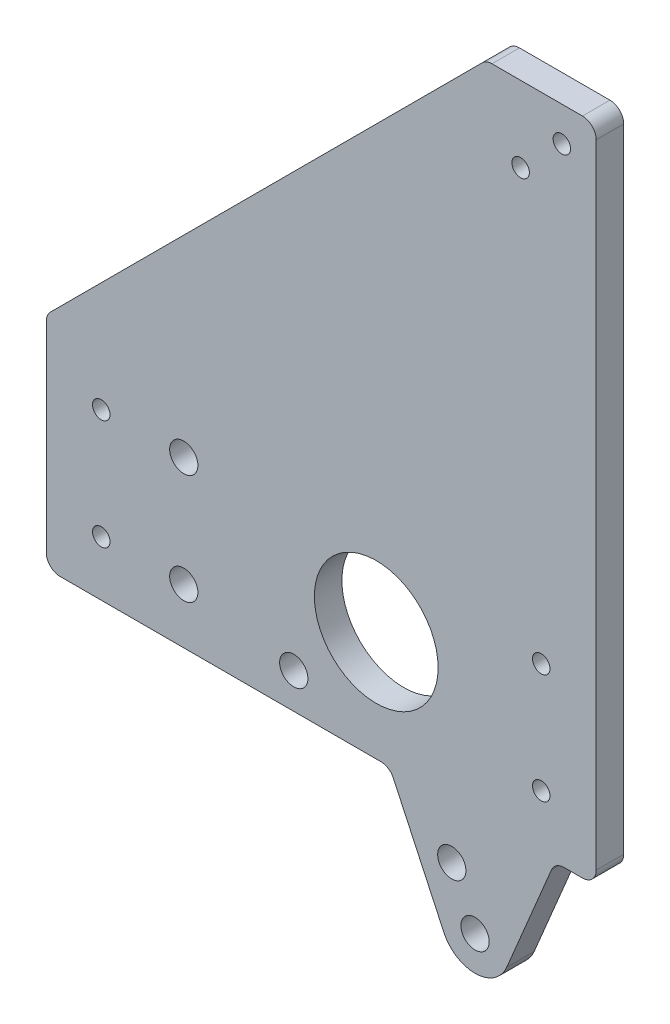
ISO-10303-21;
HEADER;
FILE_DESCRIPTION(('STEP AP214'),'2;1');
FILE_NAME('part.step','',(''),(''),'','','');
FILE_SCHEMA(('AUTOMOTIVE_DESIGN { 1 0 10303 214 1 1 1 1 }'));
ENDSEC;
DATA;
#1=APPLICATION_CONTEXT('core data for automotive mechanical design processes');
#2=APPLICATION_PROTOCOL_DEFINITION('international standard','automotive_design',2000,#1);
#3=PRODUCT_CONTEXT('',#1,'mechanical');
#4=PRODUCT('Part','Part','',(#3));
#5=PRODUCT_RELATED_PRODUCT_CATEGORY('part','',(#4));
#6=PRODUCT_DEFINITION_FORMATION('','',#4);
#7=PRODUCT_DEFINITION_CONTEXT('part definition',#1,'design');
#8=PRODUCT_DEFINITION('design','',#6,#7);
#9=PRODUCT_DEFINITION_SHAPE('','',#8);
#10=(LENGTH_UNIT() NAMED_UNIT(*) SI_UNIT(.MILLI.,.METRE.));
#11=(NAMED_UNIT(*) PLANE_ANGLE_UNIT() SI_UNIT($,.RADIAN.));
#12=(NAMED_UNIT(*) SI_UNIT($,.STERADIAN.) SOLID_ANGLE_UNIT());
#13=UNCERTAINTY_MEASURE_WITH_UNIT(LENGTH_MEASURE(1.E-05),#10,'distance_accuracy_value','');
#14=(GEOMETRIC_REPRESENTATION_CONTEXT(3) GLOBAL_UNCERTAINTY_ASSIGNED_CONTEXT((#13)) GLOBAL_UNIT_ASSIGNED_CONTEXT((#10,
#11,#12)) REPRESENTATION_CONTEXT('',''));
#15=CARTESIAN_POINT('',(0.,0.,0.));
#16=DIRECTION('',(0.,0.,1.));
#17=DIRECTION('',(1.,0.,0.));
#18=AXIS2_PLACEMENT_3D('',#15,#16,#17);
#19=CARTESIAN_POINT('',(-15.2891793225459,-99.7179628053032,6.35));
#20=DIRECTION('',(0.,0.,-1.));
#21=DIRECTION('',(-1.,0.,0.));
#22=AXIS2_PLACEMENT_3D('',#19,#20,#21);
#23=PLANE('',#22);
#24=CARTESIAN_POINT('',(-82.55,-38.1,6.35));
#25=DIRECTION('',(0.,0.,1.));
#26=DIRECTION('',(1.,0.,0.));
#27=AXIS2_PLACEMENT_3D('',#24,#25,#26);
#28=CIRCLE('',#27,3.2639);
#29=CARTESIAN_POINT('',(-79.2861,-38.1,6.35));
#30=VERTEX_POINT('',#29);
#31=EDGE_CURVE('E462',#30,#30,#28,.T.);
#32=ORIENTED_EDGE('',*,*,#31,.F.);
#33=EDGE_LOOP('',(#32));
#34=FACE_BOUND('',#33,.T.);
#35=CARTESIAN_POINT('',(-82.55,-63.5,6.35));
#36=DIRECTION('',(0.,0.,1.));
#37=DIRECTION('',(1.,0.,0.));
#38=AXIS2_PLACEMENT_3D('',#35,#36,#37);
#39=CIRCLE('',#38,3.2639);
#40=CARTESIAN_POINT('',(-79.2861,-63.5,6.35));
#41=VERTEX_POINT('',#40);
#42=EDGE_CURVE('E454',#41,#41,#39,.T.);
#43=ORIENTED_EDGE('',*,*,#42,.F.);
#44=EDGE_LOOP('',(#43));
#45=FACE_BOUND('',#44,.T.);
#46=CARTESIAN_POINT('',(-57.15,-68.0339,6.35));
#47=DIRECTION('',(0.,0.,1.));
#48=DIRECTION('',(1.,0.,0.));
#49=AXIS2_PLACEMENT_3D('',#46,#47,#48);
#50=CIRCLE('',#49,3.2639);
#51=CARTESIAN_POINT('',(-53.8861,-68.0339,6.35));
#52=VERTEX_POINT('',#51);
#53=EDGE_CURVE('E443',#52,#52,#50,.T.);
#54=ORIENTED_EDGE('',*,*,#53,.F.);
#55=EDGE_LOOP('',(#54));
#56=FACE_BOUND('',#55,.T.);
#57=CARTESIAN_POINT('',(-38.1,-50.8,6.35));
#58=DIRECTION('',(0.,0.,1.));
#59=DIRECTION('',(1.,0.,0.));
#60=AXIS2_PLACEMENT_3D('',#57,#58,#59);
#61=CIRCLE('',#60,14.2875);
#62=CARTESIAN_POINT('',(-23.8125,-50.8,6.35));
#63=VERTEX_POINT('',#62);
#64=EDGE_CURVE('E435',#63,#63,#61,.T.);
#65=ORIENTED_EDGE('',*,*,#64,.F.);
#66=EDGE_LOOP('',(#65));
#67=FACE_BOUND('',#66,.T.);
#68=CARTESIAN_POINT('',(-101.6,-63.5,6.35));
#69=DIRECTION('',(0.,0.,1.));
#70=DIRECTION('',(1.,0.,0.));
#71=AXIS2_PLACEMENT_3D('',#68,#69,#70);
#72=CIRCLE('',#71,2.01930000000001);
#73=CARTESIAN_POINT('',(-99.5807,-63.5,6.35));
#74=VERTEX_POINT('',#73);
#75=EDGE_CURVE('E428',#74,#74,#72,.T.);
#76=ORIENTED_EDGE('',*,*,#75,.F.);
#77=EDGE_LOOP('',(#76));
#78=FACE_BOUND('',#77,.T.);
#79=CARTESIAN_POINT('',(-101.6,-38.1,6.35));
#80=DIRECTION('',(0.,0.,1.));
#81=DIRECTION('',(1.,0.,0.));
#82=AXIS2_PLACEMENT_3D('',#79,#80,#81);
#83=CIRCLE('',#82,2.01930000000001);
#84=CARTESIAN_POINT('',(-99.5807,-38.1,6.35));
#85=VERTEX_POINT('',#84);
#86=EDGE_CURVE('E419',#85,#85,#83,.T.);
#87=ORIENTED_EDGE('',*,*,#86,.F.);
#88=EDGE_LOOP('',(#87));
#89=FACE_BOUND('',#88,.T.);
#90=CARTESIAN_POINT('',(0.,-63.5,6.35));
#91=DIRECTION('',(0.,0.,1.));
#92=DIRECTION('',(1.,0.,0.));
#93=AXIS2_PLACEMENT_3D('',#90,#91,#92);
#94=CIRCLE('',#93,2.0193);
#95=CARTESIAN_POINT('',(2.0193,-63.5,6.35));
#96=VERTEX_POINT('',#95);
#97=EDGE_CURVE('E412',#96,#96,#94,.T.);
#98=ORIENTED_EDGE('',*,*,#97,.F.);
#99=EDGE_LOOP('',(#98));
#100=FACE_BOUND('',#99,.T.);
#101=CARTESIAN_POINT('',(0.,-38.1,6.35));
#102=DIRECTION('',(0.,0.,1.));
#103=DIRECTION('',(1.,0.,0.));
#104=AXIS2_PLACEMENT_3D('',#101,#102,#103);
#105=CIRCLE('',#104,2.0193);
#106=CARTESIAN_POINT('',(2.0193,-38.1,6.35));
#107=VERTEX_POINT('',#106);
#108=EDGE_CURVE('E403',#107,#107,#105,.T.);
#109=ORIENTED_EDGE('',*,*,#108,.F.);
#110=EDGE_LOOP('',(#109));
#111=FACE_BOUND('',#110,.T.);
#112=CARTESIAN_POINT('',(4.7625,68.2625000000001,6.35));
#113=DIRECTION('',(0.,0.,1.));
#114=DIRECTION('',(1.,0.,0.));
#115=AXIS2_PLACEMENT_3D('',#112,#113,#114);
#116=CIRCLE('',#115,2.0193);
#117=CARTESIAN_POINT('',(6.7818,68.2625000000001,6.35));
#118=VERTEX_POINT('',#117);
#119=EDGE_CURVE('E396',#118,#118,#116,.T.);
#120=ORIENTED_EDGE('',*,*,#119,.F.);
#121=EDGE_LOOP('',(#120));
#122=FACE_BOUND('',#121,.T.);
#123=CARTESIAN_POINT('',(-4.7625,58.7375000000001,6.35));
#124=DIRECTION('',(0.,0.,1.));
#125=DIRECTION('',(1.,0.,0.));
#126=AXIS2_PLACEMENT_3D('',#123,#124,#125);
#127=CIRCLE('',#126,2.0193);
#128=CARTESIAN_POINT('',(-2.7432,58.7375000000001,6.35));
#129=VERTEX_POINT('',#128);
#130=EDGE_CURVE('E387',#129,#129,#127,.T.);
#131=ORIENTED_EDGE('',*,*,#130,.F.);
#132=EDGE_LOOP('',(#131));
#133=FACE_BOUND('',#132,.T.);
#134=DIRECTION('',(0.,-1.,0.));
#135=VECTOR('',#134,1.);
#136=CARTESIAN_POINT('',(-114.3,-76.2,6.35));
#137=LINE('',#136,#135);
#138=CARTESIAN_POINT('',(-114.3,-26.7151280605346,6.35));
#139=VERTEX_POINT('',#138);
#140=CARTESIAN_POINT('',(-114.3,-73.025,6.35));
#141=VERTEX_POINT('',#140);
#142=EDGE_CURVE('E331',#139,#141,#137,.T.);
#143=ORIENTED_EDGE('',*,*,#142,.T.);
#144=CARTESIAN_POINT('',(-111.125,-73.025,6.35));
#145=DIRECTION('',(0.,0.,-1.));
#146=DIRECTION('',(-1.,0.,0.));
#147=AXIS2_PLACEMENT_3D('',#144,#145,#146);
#148=CIRCLE('',#147,3.175);
#149=CARTESIAN_POINT('',(-111.125,-76.2,6.35));
#150=VERTEX_POINT('',#149);
#151=EDGE_CURVE('E297',#141,#150,#148,.F.);
#152=ORIENTED_EDGE('',*,*,#151,.T.);
#153=DIRECTION('',(1.,0.,0.));
#154=VECTOR('',#153,1.);
#155=CARTESIAN_POINT('',(-35.0138477146281,-76.2,6.35));
#156=LINE('',#155,#154);
#157=CARTESIAN_POINT('',(-37.0365457926919,-76.2,6.35));
#158=VERTEX_POINT('',#157);
#159=EDGE_CURVE('E166',#150,#158,#156,.T.);
#160=ORIENTED_EDGE('',*,*,#159,.T.);
#161=CARTESIAN_POINT('',(-37.0365457926919,-79.375,6.35));
#162=DIRECTION('',(0.,0.,-1.));
#163=DIRECTION('',(-1.,0.,0.));
#164=AXIS2_PLACEMENT_3D('',#161,#162,#163);
#165=CIRCLE('',#164,3.175);
#166=CARTESIAN_POINT('',(-34.1590185688505,-78.0331870189732,6.35));
#167=VERTEX_POINT('',#166);
#168=EDGE_CURVE('E161',#158,#167,#165,.T.);
#169=ORIENTED_EDGE('',*,*,#168,.T.);
#170=DIRECTION('',(0.422618261740704,-0.906307787036648,0.));
#171=VECTOR('',#170,1.);
#172=CARTESIAN_POINT('',(-22.4829973821493,-103.07249525787,6.35));
#173=LINE('',#172,#171);
#174=CARTESIAN_POINT('',(-22.4829973821493,-103.07249525787,6.35));
#175=VERTEX_POINT('',#174);
#176=EDGE_CURVE('E152',#167,#175,#173,.T.);
#177=ORIENTED_EDGE('',*,*,#176,.T.);
#178=CARTESIAN_POINT('',(-15.2891793225459,-99.7179628053032,6.35));
#179=DIRECTION('',(0.,0.,1.));
#180=DIRECTION('',(-1.,0.,0.));
#181=AXIS2_PLACEMENT_3D('',#178,#179,#180);
#182=CIRCLE('',#181,7.9375);
#183=CARTESIAN_POINT('',(-7.96873325605382,-102.786346033908,6.35));
#184=VERTEX_POINT('',#183);
#185=EDGE_CURVE('E158',#175,#184,#182,.T.);
#186=ORIENTED_EDGE('',*,*,#185,.T.);
#187=DIRECTION('',(0.386567965808431,0.922260921762779,0.));
#188=VECTOR('',#187,1.);
#189=CARTESIAN_POINT('',(-7.96873325605383,-102.786346033908,6.35));
#190=LINE('',#189,#188);
#191=CARTESIAN_POINT('',(2.35863902397406,-78.1476467085582,6.35));
#192=VERTEX_POINT('',#191);
#193=EDGE_CURVE('E183',#184,#192,#190,.T.);
#194=ORIENTED_EDGE('',*,*,#193,.T.);
#195=CARTESIAN_POINT('',(5.28681745057089,-79.375,6.35));
#196=DIRECTION('',(0.,0.,-1.));
#197=DIRECTION('',(-1.,0.,0.));
#198=AXIS2_PLACEMENT_3D('',#195,#196,#197);
#199=CIRCLE('',#198,3.175);
#200=CARTESIAN_POINT('',(5.28681745057089,-76.2,6.35));
#201=VERTEX_POINT('',#200);
#202=EDGE_CURVE('E263',#192,#201,#199,.T.);
#203=ORIENTED_EDGE('',*,*,#202,.T.);
#204=DIRECTION('',(1.,0.,0.));
#205=VECTOR('',#204,1.);
#206=CARTESIAN_POINT('',(3.175,-76.2,6.35));
#207=LINE('',#206,#205);
#208=CARTESIAN_POINT('',(9.525,-76.2,6.35));
#209=VERTEX_POINT('',#208);
#210=EDGE_CURVE('E186',#201,#209,#207,.T.);
#211=ORIENTED_EDGE('',*,*,#210,.T.);
#212=CARTESIAN_POINT('',(9.525,-73.025,6.35));
#213=DIRECTION('',(0.,0.,-1.));
#214=DIRECTION('',(-1.,0.,0.));
#215=AXIS2_PLACEMENT_3D('',#212,#213,#214);
#216=CIRCLE('',#215,3.175);
#217=CARTESIAN_POINT('',(12.7,-73.025,6.35));
#218=VERTEX_POINT('',#217);
#219=EDGE_CURVE('E248',#209,#218,#216,.F.);
#220=ORIENTED_EDGE('',*,*,#219,.T.);
#221=DIRECTION('',(0.,1.,0.));
#222=VECTOR('',#221,1.);
#223=CARTESIAN_POINT('',(12.7,-76.2,6.35));
#224=LINE('',#223,#222);
#225=CARTESIAN_POINT('',(12.7,73.0250000000001,6.35));
#226=VERTEX_POINT('',#225);
#227=EDGE_CURVE('E225',#218,#226,#224,.T.);
#228=ORIENTED_EDGE('',*,*,#227,.T.);
#229=CARTESIAN_POINT('',(9.525,73.0250000000001,6.35));
#230=DIRECTION('',(0.,0.,-1.));
#231=DIRECTION('',(-1.,0.,0.));
#232=AXIS2_PLACEMENT_3D('',#229,#230,#231);
#233=CIRCLE('',#232,3.175);
#234=CARTESIAN_POINT('',(9.525,76.2000000000001,6.35));
#235=VERTEX_POINT('',#234);
#236=EDGE_CURVE('E291',#226,#235,#233,.F.);
#237=ORIENTED_EDGE('',*,*,#236,.T.);
#238=DIRECTION('',(-1.,0.,0.));
#239=VECTOR('',#238,1.);
#240=CARTESIAN_POINT('',(-12.7,76.2000000000001,6.35));
#241=LINE('',#240,#239);
#242=CARTESIAN_POINT('',(-11.3848719394654,76.2000000000001,6.35));
#243=VERTEX_POINT('',#242);
#244=EDGE_CURVE('E316',#235,#243,#241,.T.);
#245=ORIENTED_EDGE('',*,*,#244,.T.);
#246=CARTESIAN_POINT('',(-11.3848719394654,73.0250000000001,6.35));
#247=DIRECTION('',(0.,0.,-1.));
#248=DIRECTION('',(-1.,0.,0.));
#249=AXIS2_PLACEMENT_3D('',#246,#247,#248);
#250=CIRCLE('',#249,3.175);
#251=CARTESIAN_POINT('',(-13.6299359697327,75.2700640302673,6.35));
#252=VERTEX_POINT('',#251);
#253=EDGE_CURVE('E62',#243,#252,#250,.F.);
#254=ORIENTED_EDGE('',*,*,#253,.T.);
#255=DIRECTION('',(-0.707106781186547,-0.707106781186548,0.));
#256=VECTOR('',#255,1.);
#257=CARTESIAN_POINT('',(-12.7,76.2000000000001,6.35));
#258=LINE('',#257,#256);
#259=CARTESIAN_POINT('',(-113.370064030267,-24.4700640302673,6.35));
#260=VERTEX_POINT('',#259);
#261=EDGE_CURVE('E328',#252,#260,#258,.T.);
#262=ORIENTED_EDGE('',*,*,#261,.T.);
#263=CARTESIAN_POINT('',(-111.125,-26.7151280605346,6.35));
#264=DIRECTION('',(0.,0.,-1.));
#265=DIRECTION('',(-1.,0.,0.));
#266=AXIS2_PLACEMENT_3D('',#263,#264,#265);
#267=CIRCLE('',#266,3.175);
#268=EDGE_CURVE('E294',#260,#139,#267,.F.);
#269=ORIENTED_EDGE('',*,*,#268,.T.);
#270=EDGE_LOOP('',(#143,#152,#160,#169,#177,#186,#194,#203,#211,#220,#228,#237,#245,#254,#262,#269));
#271=FACE_BOUND('',#270,.T.);
#272=CARTESIAN_POINT('',(-15.2891793225459,-99.7179628053032,6.35));
#273=DIRECTION('',(0.,0.,1.));
#274=DIRECTION('',(1.,0.,0.));
#275=AXIS2_PLACEMENT_3D('',#272,#273,#274);
#276=CIRCLE('',#275,3.2639);
#277=CARTESIAN_POINT('',(-12.0252793225459,-99.7179628053032,6.35));
#278=VERTEX_POINT('',#277);
#279=EDGE_CURVE('E198',#278,#278,#276,.T.);
#280=ORIENTED_EDGE('',*,*,#279,.F.);
#281=EDGE_LOOP('',(#280));
#282=FACE_BOUND('',#281,.T.);
#283=CARTESIAN_POINT('',(-20.6564312466527,-88.2078539099377,6.35));
#284=DIRECTION('',(0.,0.,1.));
#285=DIRECTION('',(1.,0.,0.));
#286=AXIS2_PLACEMENT_3D('',#283,#284,#285);
#287=CIRCLE('',#286,3.26390000000001);
#288=CARTESIAN_POINT('',(-17.3925312466527,-88.2078539099377,6.35));
#289=VERTEX_POINT('',#288);
#290=EDGE_CURVE('E375',#289,#289,#287,.T.);
#291=ORIENTED_EDGE('',*,*,#290,.F.);
#292=EDGE_LOOP('',(#291));
#293=FACE_BOUND('',#292,.T.);
#294=ADVANCED_FACE('F39',(#34,#45,#56,#67,#78,#89,#100,#111,#122,#133,#271,#282,#293),#23,.F.);
#295=CARTESIAN_POINT('',(-15.2891793225459,-99.7179628053032,0.));
#296=DIRECTION('',(0.,0.,-1.));
#297=DIRECTION('',(-1.,0.,0.));
#298=AXIS2_PLACEMENT_3D('',#295,#296,#297);
#299=PLANE('',#298);
#300=CARTESIAN_POINT('',(-82.55,-38.1,0.));
#301=DIRECTION('',(0.,0.,1.));
#302=DIRECTION('',(1.,0.,0.));
#303=AXIS2_PLACEMENT_3D('',#300,#301,#302);
#304=CIRCLE('',#303,3.2639);
#305=CARTESIAN_POINT('',(-79.2861,-38.1,0.));
#306=VERTEX_POINT('',#305);
#307=EDGE_CURVE('E458',#306,#306,#304,.T.);
#308=ORIENTED_EDGE('',*,*,#307,.T.);
#309=EDGE_LOOP('',(#308));
#310=FACE_BOUND('',#309,.T.);
#311=CARTESIAN_POINT('',(-82.55,-63.5,0.));
#312=DIRECTION('',(0.,0.,1.));
#313=DIRECTION('',(1.,0.,0.));
#314=AXIS2_PLACEMENT_3D('',#311,#312,#313);
#315=CIRCLE('',#314,3.2639);
#316=CARTESIAN_POINT('',(-79.2861,-63.5,0.));
#317=VERTEX_POINT('',#316);
#318=EDGE_CURVE('E447',#317,#317,#315,.T.);
#319=ORIENTED_EDGE('',*,*,#318,.T.);
#320=EDGE_LOOP('',(#319));
#321=FACE_BOUND('',#320,.T.);
#322=CARTESIAN_POINT('',(-57.15,-68.0339,0.));
#323=DIRECTION('',(0.,0.,1.));
#324=DIRECTION('',(1.,0.,0.));
#325=AXIS2_PLACEMENT_3D('',#322,#323,#324);
#326=CIRCLE('',#325,3.2639);
#327=CARTESIAN_POINT('',(-53.8861,-68.0339,0.));
#328=VERTEX_POINT('',#327);
#329=EDGE_CURVE('E439',#328,#328,#326,.T.);
#330=ORIENTED_EDGE('',*,*,#329,.T.);
#331=EDGE_LOOP('',(#330));
#332=FACE_BOUND('',#331,.T.);
#333=CARTESIAN_POINT('',(-38.1,-50.8,0.));
#334=DIRECTION('',(0.,0.,1.));
#335=DIRECTION('',(1.,0.,0.));
#336=AXIS2_PLACEMENT_3D('',#333,#334,#335);
#337=CIRCLE('',#336,14.2875);
#338=CARTESIAN_POINT('',(-23.8125,-50.8,0.));
#339=VERTEX_POINT('',#338);
#340=EDGE_CURVE('E424',#339,#339,#337,.T.);
#341=ORIENTED_EDGE('',*,*,#340,.T.);
#342=EDGE_LOOP('',(#341));
#343=FACE_BOUND('',#342,.T.);
#344=CARTESIAN_POINT('',(-101.6,-63.5,0.));
#345=DIRECTION('',(0.,0.,1.));
#346=DIRECTION('',(1.,0.,0.));
#347=AXIS2_PLACEMENT_3D('',#344,#345,#346);
#348=CIRCLE('',#347,2.01930000000001);
#349=CARTESIAN_POINT('',(-99.5807,-63.5,0.));
#350=VERTEX_POINT('',#349);
#351=EDGE_CURVE('E408',#350,#350,#348,.T.);
#352=ORIENTED_EDGE('',*,*,#351,.T.);
#353=EDGE_LOOP('',(#352));
#354=FACE_BOUND('',#353,.T.);
#355=CARTESIAN_POINT('',(-101.6,-38.1,0.));
#356=DIRECTION('',(0.,0.,1.));
#357=DIRECTION('',(1.,0.,0.));
#358=AXIS2_PLACEMENT_3D('',#355,#356,#357);
#359=CIRCLE('',#358,2.01930000000001);
#360=CARTESIAN_POINT('',(-99.5807,-38.1,0.));
#361=VERTEX_POINT('',#360);
#362=EDGE_CURVE('E423',#361,#361,#359,.T.);
#363=ORIENTED_EDGE('',*,*,#362,.T.);
#364=EDGE_LOOP('',(#363));
#365=FACE_BOUND('',#364,.T.);
#366=CARTESIAN_POINT('',(0.,-63.5,0.));
#367=DIRECTION('',(0.,0.,1.));
#368=DIRECTION('',(1.,0.,0.));
#369=AXIS2_PLACEMENT_3D('',#366,#367,#368);
#370=CIRCLE('',#369,2.0193);
#371=CARTESIAN_POINT('',(2.0193,-63.5,0.));
#372=VERTEX_POINT('',#371);
#373=EDGE_CURVE('E392',#372,#372,#370,.T.);
#374=ORIENTED_EDGE('',*,*,#373,.T.);
#375=EDGE_LOOP('',(#374));
#376=FACE_BOUND('',#375,.T.);
#377=CARTESIAN_POINT('',(0.,-38.1,0.));
#378=DIRECTION('',(0.,0.,1.));
#379=DIRECTION('',(1.,0.,0.));
#380=AXIS2_PLACEMENT_3D('',#377,#378,#379);
#381=CIRCLE('',#380,2.0193);
#382=CARTESIAN_POINT('',(2.0193,-38.1,0.));
#383=VERTEX_POINT('',#382);
#384=EDGE_CURVE('E407',#383,#383,#381,.T.);
#385=ORIENTED_EDGE('',*,*,#384,.T.);
#386=EDGE_LOOP('',(#385));
#387=FACE_BOUND('',#386,.T.);
#388=CARTESIAN_POINT('',(4.7625,68.2625000000001,0.));
#389=DIRECTION('',(0.,0.,1.));
#390=DIRECTION('',(1.,0.,0.));
#391=AXIS2_PLACEMENT_3D('',#388,#389,#390);
#392=CIRCLE('',#391,2.0193);
#393=CARTESIAN_POINT('',(6.7818,68.2625000000001,0.));
#394=VERTEX_POINT('',#393);
#395=EDGE_CURVE('E383',#394,#394,#392,.T.);
#396=ORIENTED_EDGE('',*,*,#395,.T.);
#397=EDGE_LOOP('',(#396));
#398=FACE_BOUND('',#397,.T.);
#399=CARTESIAN_POINT('',(-4.7625,58.7375000000001,0.));
#400=DIRECTION('',(0.,0.,1.));
#401=DIRECTION('',(1.,0.,0.));
#402=AXIS2_PLACEMENT_3D('',#399,#400,#401);
#403=CIRCLE('',#402,2.0193);
#404=CARTESIAN_POINT('',(-2.7432,58.7375000000001,0.));
#405=VERTEX_POINT('',#404);
#406=EDGE_CURVE('E391',#405,#405,#403,.T.);
#407=ORIENTED_EDGE('',*,*,#406,.T.);
#408=EDGE_LOOP('',(#407));
#409=FACE_BOUND('',#408,.T.);
#410=CARTESIAN_POINT('',(-15.2891793225459,-99.7179628053032,0.));
#411=DIRECTION('',(0.,0.,1.));
#412=DIRECTION('',(1.,0.,0.));
#413=AXIS2_PLACEMENT_3D('',#410,#411,#412);
#414=CIRCLE('',#413,3.2639);
#415=CARTESIAN_POINT('',(-12.0252793225459,-99.7179628053032,0.));
#416=VERTEX_POINT('',#415);
#417=EDGE_CURVE('E371',#416,#416,#414,.T.);
#418=ORIENTED_EDGE('',*,*,#417,.T.);
#419=EDGE_LOOP('',(#418));
#420=FACE_BOUND('',#419,.T.);
#421=DIRECTION('',(1.,0.,0.));
#422=VECTOR('',#421,1.);
#423=CARTESIAN_POINT('',(-35.0138477146281,-76.2,0.));
#424=LINE('',#423,#422);
#425=CARTESIAN_POINT('',(-111.125,-76.2,0.));
#426=VERTEX_POINT('',#425);
#427=CARTESIAN_POINT('',(-37.0365457926919,-76.2,0.));
#428=VERTEX_POINT('',#427);
#429=EDGE_CURVE('E209',#426,#428,#424,.T.);
#430=ORIENTED_EDGE('',*,*,#429,.F.);
#431=CARTESIAN_POINT('',(-111.125,-73.025,0.));
#432=DIRECTION('',(0.,0.,-1.));
#433=DIRECTION('',(-1.,0.,0.));
#434=AXIS2_PLACEMENT_3D('',#431,#432,#433);
#435=CIRCLE('',#434,3.175);
#436=CARTESIAN_POINT('',(-114.3,-73.025,0.));
#437=VERTEX_POINT('',#436);
#438=EDGE_CURVE('E279',#426,#437,#435,.T.);
#439=ORIENTED_EDGE('',*,*,#438,.T.);
#440=DIRECTION('',(0.,-1.,0.));
#441=VECTOR('',#440,1.);
#442=CARTESIAN_POINT('',(-114.3,-76.2,0.));
#443=LINE('',#442,#441);
#444=CARTESIAN_POINT('',(-114.3,-26.7151280605346,0.));
#445=VERTEX_POINT('',#444);
#446=EDGE_CURVE('E205',#445,#437,#443,.T.);
#447=ORIENTED_EDGE('',*,*,#446,.F.);
#448=CARTESIAN_POINT('',(-111.125,-26.7151280605346,0.));
#449=DIRECTION('',(0.,0.,-1.));
#450=DIRECTION('',(-1.,0.,0.));
#451=AXIS2_PLACEMENT_3D('',#448,#449,#450);
#452=CIRCLE('',#451,3.175);
#453=CARTESIAN_POINT('',(-113.370064030267,-24.4700640302673,0.));
#454=VERTEX_POINT('',#453);
#455=EDGE_CURVE('E276',#445,#454,#452,.T.);
#456=ORIENTED_EDGE('',*,*,#455,.T.);
#457=DIRECTION('',(-0.707106781186547,-0.707106781186548,0.));
#458=VECTOR('',#457,1.);
#459=CARTESIAN_POINT('',(-12.7,76.2000000000001,0.));
#460=LINE('',#459,#458);
#461=CARTESIAN_POINT('',(-13.6299359697327,75.2700640302673,0.));
#462=VERTEX_POINT('',#461);
#463=EDGE_CURVE('E202',#462,#454,#460,.T.);
#464=ORIENTED_EDGE('',*,*,#463,.F.);
#465=CARTESIAN_POINT('',(-11.3848719394654,73.0250000000001,0.));
#466=DIRECTION('',(0.,0.,-1.));
#467=DIRECTION('',(-1.,0.,0.));
#468=AXIS2_PLACEMENT_3D('',#465,#466,#467);
#469=CIRCLE('',#468,3.175);
#470=CARTESIAN_POINT('',(-11.3848719394654,76.2000000000001,0.));
#471=VERTEX_POINT('',#470);
#472=EDGE_CURVE('E270',#462,#471,#469,.T.);
#473=ORIENTED_EDGE('',*,*,#472,.T.);
#474=DIRECTION('',(-1.,0.,0.));
#475=VECTOR('',#474,1.);
#476=CARTESIAN_POINT('',(-12.7,76.2000000000001,0.));
#477=LINE('',#476,#475);
#478=CARTESIAN_POINT('',(9.525,76.2000000000001,0.));
#479=VERTEX_POINT('',#478);
#480=EDGE_CURVE('E197',#479,#471,#477,.T.);
#481=ORIENTED_EDGE('',*,*,#480,.F.);
#482=CARTESIAN_POINT('',(9.525,73.0250000000001,0.));
#483=DIRECTION('',(0.,0.,-1.));
#484=DIRECTION('',(-1.,0.,0.));
#485=AXIS2_PLACEMENT_3D('',#482,#483,#484);
#486=CIRCLE('',#485,3.175);
#487=CARTESIAN_POINT('',(12.7,73.0250000000001,0.));
#488=VERTEX_POINT('',#487);
#489=EDGE_CURVE('E273',#479,#488,#486,.T.);
#490=ORIENTED_EDGE('',*,*,#489,.T.);
#491=DIRECTION('',(0.,1.,0.));
#492=VECTOR('',#491,1.);
#493=CARTESIAN_POINT('',(12.7,-76.2,0.));
#494=LINE('',#493,#492);
#495=CARTESIAN_POINT('',(12.7,-73.025,0.));
#496=VERTEX_POINT('',#495);
#497=EDGE_CURVE('E193',#496,#488,#494,.T.);
#498=ORIENTED_EDGE('',*,*,#497,.F.);
#499=CARTESIAN_POINT('',(9.525,-73.025,0.));
#500=DIRECTION('',(0.,0.,-1.));
#501=DIRECTION('',(-1.,0.,0.));
#502=AXIS2_PLACEMENT_3D('',#499,#500,#501);
#503=CIRCLE('',#502,3.175);
#504=CARTESIAN_POINT('',(9.525,-76.2,0.));
#505=VERTEX_POINT('',#504);
#506=EDGE_CURVE('E238',#496,#505,#503,.T.);
#507=ORIENTED_EDGE('',*,*,#506,.T.);
#508=DIRECTION('',(1.,0.,0.));
#509=VECTOR('',#508,1.);
#510=CARTESIAN_POINT('',(3.175,-76.2,0.));
#511=LINE('',#510,#509);
#512=CARTESIAN_POINT('',(5.28681745057089,-76.2,0.));
#513=VERTEX_POINT('',#512);
#514=EDGE_CURVE('E221',#513,#505,#511,.T.);
#515=ORIENTED_EDGE('',*,*,#514,.F.);
#516=CARTESIAN_POINT('',(5.28681745057089,-79.375,0.));
#517=DIRECTION('',(0.,0.,-1.));
#518=DIRECTION('',(-1.,0.,0.));
#519=AXIS2_PLACEMENT_3D('',#516,#517,#518);
#520=CIRCLE('',#519,3.175);
#521=CARTESIAN_POINT('',(2.35863902397406,-78.1476467085582,0.));
#522=VERTEX_POINT('',#521);
#523=EDGE_CURVE('E260',#513,#522,#520,.F.);
#524=ORIENTED_EDGE('',*,*,#523,.T.);
#525=DIRECTION('',(0.386567965808431,0.922260921762779,0.));
#526=VECTOR('',#525,1.);
#527=CARTESIAN_POINT('',(-7.96873325605383,-102.786346033908,0.));
#528=LINE('',#527,#526);
#529=CARTESIAN_POINT('',(-7.96873325605382,-102.786346033908,0.));
#530=VERTEX_POINT('',#529);
#531=EDGE_CURVE('E217',#530,#522,#528,.T.);
#532=ORIENTED_EDGE('',*,*,#531,.F.);
#533=CARTESIAN_POINT('',(-15.2891793225459,-99.7179628053032,0.));
#534=DIRECTION('',(0.,0.,1.));
#535=DIRECTION('',(-1.,0.,0.));
#536=AXIS2_PLACEMENT_3D('',#533,#534,#535);
#537=CIRCLE('',#536,7.9375);
#538=CARTESIAN_POINT('',(-22.4829973821493,-103.07249525787,0.));
#539=VERTEX_POINT('',#538);
#540=EDGE_CURVE('E214',#539,#530,#537,.T.);
#541=ORIENTED_EDGE('',*,*,#540,.F.);
#542=DIRECTION('',(0.422618261740704,-0.906307787036648,0.));
#543=VECTOR('',#542,1.);
#544=CARTESIAN_POINT('',(-22.4829973821493,-103.07249525787,0.));
#545=LINE('',#544,#543);
#546=CARTESIAN_POINT('',(-34.1590185688505,-78.0331870189732,0.));
#547=VERTEX_POINT('',#546);
#548=EDGE_CURVE('E172',#547,#539,#545,.T.);
#549=ORIENTED_EDGE('',*,*,#548,.F.);
#550=CARTESIAN_POINT('',(-37.0365457926919,-79.375,0.));
#551=DIRECTION('',(0.,0.,-1.));
#552=DIRECTION('',(-1.,0.,0.));
#553=AXIS2_PLACEMENT_3D('',#550,#551,#552);
#554=CIRCLE('',#553,3.175);
#555=EDGE_CURVE('E254',#547,#428,#554,.F.);
#556=ORIENTED_EDGE('',*,*,#555,.T.);
#557=EDGE_LOOP('',(#430,#439,#447,#456,#464,#473,#481,#490,#498,#507,#515,#524,#532,#541,#549,#556));
#558=FACE_BOUND('',#557,.T.);
#559=CARTESIAN_POINT('',(-20.6564312466527,-88.2078539099377,0.));
#560=DIRECTION('',(0.,0.,1.));
#561=DIRECTION('',(1.,0.,0.));
#562=AXIS2_PLACEMENT_3D('',#559,#560,#561);
#563=CIRCLE('',#562,3.26390000000001);
#564=CARTESIAN_POINT('',(-17.3925312466527,-88.2078539099377,0.));
#565=VERTEX_POINT('',#564);
#566=EDGE_CURVE('E379',#565,#565,#563,.T.);
#567=ORIENTED_EDGE('',*,*,#566,.T.);
#568=EDGE_LOOP('',(#567));
#569=FACE_BOUND('',#568,.T.);
#570=ADVANCED_FACE('F321',(#310,#321,#332,#343,#354,#365,#376,#387,#398,#409,#420,#558,#569),
#299,.T.);
#571=CARTESIAN_POINT('',(12.7,-76.2,6.35));
#572=DIRECTION('',(-1.,0.,0.));
#573=DIRECTION('',(0.,0.,1.));
#574=AXIS2_PLACEMENT_3D('',#571,#572,#573);
#575=PLANE('',#574);
#576=ORIENTED_EDGE('',*,*,#497,.T.);
#577=DIRECTION('',(0.,0.,-1.));
#578=VECTOR('',#577,1.);
#579=CARTESIAN_POINT('',(12.7,73.0250000000001,6.35));
#580=LINE('',#579,#578);
#581=EDGE_CURVE('E11',#488,#226,#580,.F.);
#582=ORIENTED_EDGE('',*,*,#581,.T.);
#583=ORIENTED_EDGE('',*,*,#227,.F.);
#584=DIRECTION('',(0.,0.,-1.));
#585=VECTOR('',#584,1.);
#586=CARTESIAN_POINT('',(12.7,-73.025,6.35));
#587=LINE('',#586,#585);
#588=EDGE_CURVE('E234',#218,#496,#587,.T.);
#589=ORIENTED_EDGE('',*,*,#588,.T.);
#590=EDGE_LOOP('',(#576,#582,#583,#589));
#591=FACE_BOUND('',#590,.T.);
#592=ADVANCED_FACE('F366',(#591),#575,.F.);
#593=CARTESIAN_POINT('',(-12.7,76.2000000000001,6.35));
#594=DIRECTION('',(0.,-1.,0.));
#595=DIRECTION('',(0.,0.,-1.));
#596=AXIS2_PLACEMENT_3D('',#593,#594,#595);
#597=PLANE('',#596);
#598=ORIENTED_EDGE('',*,*,#244,.F.);
#599=DIRECTION('',(0.,0.,-1.));
#600=VECTOR('',#599,1.);
#601=CARTESIAN_POINT('',(9.525,76.2000000000001,6.35));
#602=LINE('',#601,#600);
#603=EDGE_CURVE('E48',#235,#479,#602,.T.);
#604=ORIENTED_EDGE('',*,*,#603,.T.);
#605=ORIENTED_EDGE('',*,*,#480,.T.);
#606=DIRECTION('',(0.,0.,-1.));
#607=VECTOR('',#606,1.);
#608=CARTESIAN_POINT('',(-11.3848719394654,76.2000000000001,6.35));
#609=LINE('',#608,#607);
#610=EDGE_CURVE('E306',#471,#243,#609,.F.);
#611=ORIENTED_EDGE('',*,*,#610,.T.);
#612=EDGE_LOOP('',(#598,#604,#605,#611));
#613=FACE_BOUND('',#612,.T.);
#614=ADVANCED_FACE('F314',(#613),#597,.F.);
#615=CARTESIAN_POINT('',(-12.7,76.2000000000001,6.35));
#616=DIRECTION('',(0.707106781186548,-0.707106781186547,0.));
#617=DIRECTION('',(0.707106781186547,0.707106781186548,0.));
#618=AXIS2_PLACEMENT_3D('',#615,#616,#617);
#619=PLANE('',#618);
#620=ORIENTED_EDGE('',*,*,#463,.T.);
#621=DIRECTION('',(0.,0.,-1.));
#622=VECTOR('',#621,1.);
#623=CARTESIAN_POINT('',(-113.370064030267,-24.4700640302673,6.35));
#624=LINE('',#623,#622);
#625=EDGE_CURVE('E55',#454,#260,#624,.F.);
#626=ORIENTED_EDGE('',*,*,#625,.T.);
#627=ORIENTED_EDGE('',*,*,#261,.F.);
#628=DIRECTION('',(0.,0.,-1.));
#629=VECTOR('',#628,1.);
#630=CARTESIAN_POINT('',(-13.6299359697327,75.2700640302673,6.35));
#631=LINE('',#630,#629);
#632=EDGE_CURVE('E300',#252,#462,#631,.T.);
#633=ORIENTED_EDGE('',*,*,#632,.T.);
#634=EDGE_LOOP('',(#620,#626,#627,#633));
#635=FACE_BOUND('',#634,.T.);
#636=ADVANCED_FACE('F327',(#635),#619,.F.);
#637=CARTESIAN_POINT('',(-114.3,-76.2,6.35));
#638=DIRECTION('',(1.,0.,0.));
#639=DIRECTION('',(0.,0.,-1.));
#640=AXIS2_PLACEMENT_3D('',#637,#638,#639);
#641=PLANE('',#640);
#642=ORIENTED_EDGE('',*,*,#446,.T.);
#643=DIRECTION('',(0.,0.,-1.));
#644=VECTOR('',#643,1.);
#645=CARTESIAN_POINT('',(-114.3,-73.025,6.35));
#646=LINE('',#645,#644);
#647=EDGE_CURVE('E286',#437,#141,#646,.F.);
#648=ORIENTED_EDGE('',*,*,#647,.T.);
#649=ORIENTED_EDGE('',*,*,#142,.F.);
#650=DIRECTION('',(0.,0.,-1.));
#651=VECTOR('',#650,1.);
#652=CARTESIAN_POINT('',(-114.3,-26.7151280605346,6.35));
#653=LINE('',#652,#651);
#654=EDGE_CURVE('E282',#139,#445,#653,.T.);
#655=ORIENTED_EDGE('',*,*,#654,.T.);
#656=EDGE_LOOP('',(#642,#648,#649,#655));
#657=FACE_BOUND('',#656,.T.);
#658=ADVANCED_FACE('F525',(#657),#641,.F.);
#659=CARTESIAN_POINT('',(-35.0138477146281,-76.2,6.35));
#660=DIRECTION('',(0.,1.,0.));
#661=DIRECTION('',(-1.,0.,0.));
#662=AXIS2_PLACEMENT_3D('',#659,#660,#661);
#663=PLANE('',#662);
#664=ORIENTED_EDGE('',*,*,#159,.F.);
#665=DIRECTION('',(0.,0.,-1.));
#666=VECTOR('',#665,1.);
#667=CARTESIAN_POINT('',(-111.125,-76.2,6.35));
#668=LINE('',#667,#666);
#669=EDGE_CURVE('E266',#150,#426,#668,.T.);
#670=ORIENTED_EDGE('',*,*,#669,.T.);
#671=ORIENTED_EDGE('',*,*,#429,.T.);
#672=DIRECTION('',(0.,0.,-1.));
#673=VECTOR('',#672,1.);
#674=CARTESIAN_POINT('',(-37.0365457926919,-76.2,6.35));
#675=LINE('',#674,#673);
#676=EDGE_CURVE('E230',#428,#158,#675,.F.);
#677=ORIENTED_EDGE('',*,*,#676,.T.);
#678=EDGE_LOOP('',(#664,#670,#671,#677));
#679=FACE_BOUND('',#678,.T.);
#680=ADVANCED_FACE('F344',(#679),#663,.F.);
#681=CARTESIAN_POINT('',(-22.4829973821493,-103.07249525787,6.35));
#682=DIRECTION('',(0.906307787036648,0.422618261740704,0.));
#683=DIRECTION('',(-0.422618261740704,0.906307787036648,0.));
#684=AXIS2_PLACEMENT_3D('',#681,#682,#683);
#685=PLANE('',#684);
#686=ORIENTED_EDGE('',*,*,#176,.F.);
#687=DIRECTION('',(0.,0.,-1.));
#688=VECTOR('',#687,1.);
#689=CARTESIAN_POINT('',(-34.1590185688506,-78.0331870189732,0.));
#690=LINE('',#689,#688);
#691=EDGE_CURVE('E176',#167,#547,#690,.T.);
#692=ORIENTED_EDGE('',*,*,#691,.T.);
#693=ORIENTED_EDGE('',*,*,#548,.T.);
#694=DIRECTION('',(0.,0.,-1.));
#695=VECTOR('',#694,1.);
#696=CARTESIAN_POINT('',(-22.4829973821493,-103.07249525787,6.35));
#697=LINE('',#696,#695);
#698=EDGE_CURVE('E169',#175,#539,#697,.T.);
#699=ORIENTED_EDGE('',*,*,#698,.F.);
#700=EDGE_LOOP('',(#686,#692,#693,#699));
#701=FACE_BOUND('',#700,.T.);
#702=ADVANCED_FACE('F170',(#701),#685,.F.);
#703=CARTESIAN_POINT('',(-15.2891793225459,-99.7179628053032,6.35));
#704=DIRECTION('',(0.,0.,-1.));
#705=DIRECTION('',(-1.,0.,0.));
#706=AXIS2_PLACEMENT_3D('',#703,#704,#705);
#707=CYLINDRICAL_SURFACE('',#706,7.9375);
#708=ORIENTED_EDGE('',*,*,#540,.T.);
#709=DIRECTION('',(0.,0.,-1.));
#710=VECTOR('',#709,1.);
#711=CARTESIAN_POINT('',(-7.96873325605382,-102.786346033908,6.35));
#712=LINE('',#711,#710);
#713=EDGE_CURVE('E177',#184,#530,#712,.T.);
#714=ORIENTED_EDGE('',*,*,#713,.F.);
#715=ORIENTED_EDGE('',*,*,#185,.F.);
#716=ORIENTED_EDGE('',*,*,#698,.T.);
#717=EDGE_LOOP('',(#708,#714,#715,#716));
#718=FACE_BOUND('',#717,.T.);
#719=ADVANCED_FACE('F179',(#718),#707,.T.);
#720=CARTESIAN_POINT('',(-7.96873325605383,-102.786346033908,6.35));
#721=DIRECTION('',(-0.922260921762779,0.386567965808431,0.));
#722=DIRECTION('',(-0.386567965808432,-0.92226092176278,0.));
#723=AXIS2_PLACEMENT_3D('',#720,#721,#722);
#724=PLANE('',#723);
#725=ORIENTED_EDGE('',*,*,#531,.T.);
#726=DIRECTION('',(0.,0.,-1.));
#727=VECTOR('',#726,1.);
#728=CARTESIAN_POINT('',(2.35863902397406,-78.1476467085582,6.35));
#729=LINE('',#728,#727);
#730=EDGE_CURVE('E251',#522,#192,#729,.F.);
#731=ORIENTED_EDGE('',*,*,#730,.T.);
#732=ORIENTED_EDGE('',*,*,#193,.F.);
#733=ORIENTED_EDGE('',*,*,#713,.T.);
#734=EDGE_LOOP('',(#725,#731,#732,#733));
#735=FACE_BOUND('',#734,.T.);
#736=ADVANCED_FACE('F349',(#735),#724,.F.);
#737=CARTESIAN_POINT('',(3.175,-76.2,6.35));
#738=DIRECTION('',(0.,1.,0.));
#739=DIRECTION('',(0.,0.,1.));
#740=AXIS2_PLACEMENT_3D('',#737,#738,#739);
#741=PLANE('',#740);
#742=ORIENTED_EDGE('',*,*,#514,.T.);
#743=DIRECTION('',(0.,0.,-1.));
#744=VECTOR('',#743,1.);
#745=CARTESIAN_POINT('',(9.525,-76.2,6.35));
#746=LINE('',#745,#744);
#747=EDGE_CURVE('E245',#505,#209,#746,.F.);
#748=ORIENTED_EDGE('',*,*,#747,.T.);
#749=ORIENTED_EDGE('',*,*,#210,.F.);
#750=DIRECTION('',(0.,0.,-1.));
#751=VECTOR('',#750,1.);
#752=CARTESIAN_POINT('',(5.28681745057089,-76.2,0.));
#753=LINE('',#752,#751);
#754=EDGE_CURVE('E241',#201,#513,#753,.T.);
#755=ORIENTED_EDGE('',*,*,#754,.T.);
#756=EDGE_LOOP('',(#742,#748,#749,#755));
#757=FACE_BOUND('',#756,.T.);
#758=ADVANCED_FACE('F358',(#757),#741,.F.);
#759=CARTESIAN_POINT('',(-15.2891793225459,-99.7179628053032,6.35));
#760=DIRECTION('',(0.,0.,-1.));
#761=DIRECTION('',(-1.,0.,0.));
#762=AXIS2_PLACEMENT_3D('',#759,#760,#761);
#763=CYLINDRICAL_SURFACE('',#762,3.2639);
#764=ORIENTED_EDGE('',*,*,#279,.T.);
#765=EDGE_LOOP('',(#764));
#766=FACE_BOUND('',#765,.T.);
#767=ORIENTED_EDGE('',*,*,#417,.F.);
#768=EDGE_LOOP('',(#767));
#769=FACE_BOUND('',#768,.T.);
#770=ADVANCED_FACE('F503',(#766,#769),#763,.F.);
#771=CARTESIAN_POINT('',(-20.6564312466527,-88.2078539099377,6.35));
#772=DIRECTION('',(0.,0.,-1.));
#773=DIRECTION('',(-1.,0.,0.));
#774=AXIS2_PLACEMENT_3D('',#771,#772,#773);
#775=CYLINDRICAL_SURFACE('',#774,3.26390000000001);
#776=ORIENTED_EDGE('',*,*,#290,.T.);
#777=EDGE_LOOP('',(#776));
#778=FACE_BOUND('',#777,.T.);
#779=ORIENTED_EDGE('',*,*,#566,.F.);
#780=EDGE_LOOP('',(#779));
#781=FACE_BOUND('',#780,.T.);
#782=ADVANCED_FACE('F493',(#778,#781),#775,.F.);
#783=CARTESIAN_POINT('',(-4.7625,58.7375000000001,0.));
#784=DIRECTION('',(0.,0.,1.));
#785=DIRECTION('',(1.,0.,0.));
#786=AXIS2_PLACEMENT_3D('',#783,#784,#785);
#787=CYLINDRICAL_SURFACE('',#786,2.0193);
#788=ORIENTED_EDGE('',*,*,#406,.F.);
#789=EDGE_LOOP('',(#788));
#790=FACE_BOUND('',#789,.T.);
#791=ORIENTED_EDGE('',*,*,#130,.T.);
#792=EDGE_LOOP('',(#791));
#793=FACE_BOUND('',#792,.T.);
#794=ADVANCED_FACE('F490',(#790,#793),#787,.F.);
#795=CARTESIAN_POINT('',(4.7625,68.2625000000001,0.));
#796=DIRECTION('',(0.,0.,1.));
#797=DIRECTION('',(1.,0.,0.));
#798=AXIS2_PLACEMENT_3D('',#795,#796,#797);
#799=CYLINDRICAL_SURFACE('',#798,2.0193);
#800=ORIENTED_EDGE('',*,*,#395,.F.);
#801=EDGE_LOOP('',(#800));
#802=FACE_BOUND('',#801,.T.);
#803=ORIENTED_EDGE('',*,*,#119,.T.);
#804=EDGE_LOOP('',(#803));
#805=FACE_BOUND('',#804,.T.);
#806=ADVANCED_FACE('F492',(#802,#805),#799,.F.);
#807=CARTESIAN_POINT('',(0.,-38.1,0.));
#808=DIRECTION('',(0.,0.,1.));
#809=DIRECTION('',(1.,0.,0.));
#810=AXIS2_PLACEMENT_3D('',#807,#808,#809);
#811=CYLINDRICAL_SURFACE('',#810,2.0193);
#812=ORIENTED_EDGE('',*,*,#384,.F.);
#813=EDGE_LOOP('',(#812));
#814=FACE_BOUND('',#813,.T.);
#815=ORIENTED_EDGE('',*,*,#108,.T.);
#816=EDGE_LOOP('',(#815));
#817=FACE_BOUND('',#816,.T.);
#818=ADVANCED_FACE('F500',(#814,#817),#811,.F.);
#819=CARTESIAN_POINT('',(0.,-63.5,0.));
#820=DIRECTION('',(0.,0.,1.));
#821=DIRECTION('',(1.,0.,0.));
#822=AXIS2_PLACEMENT_3D('',#819,#820,#821);
#823=CYLINDRICAL_SURFACE('',#822,2.0193);
#824=ORIENTED_EDGE('',*,*,#373,.F.);
#825=EDGE_LOOP('',(#824));
#826=FACE_BOUND('',#825,.T.);
#827=ORIENTED_EDGE('',*,*,#97,.T.);
#828=EDGE_LOOP('',(#827));
#829=FACE_BOUND('',#828,.T.);
#830=ADVANCED_FACE('F710',(#826,#829),#823,.F.);
#831=CARTESIAN_POINT('',(-101.6,-38.1,0.));
#832=DIRECTION('',(0.,0.,1.));
#833=DIRECTION('',(1.,0.,0.));
#834=AXIS2_PLACEMENT_3D('',#831,#832,#833);
#835=CYLINDRICAL_SURFACE('',#834,2.01930000000001);
#836=ORIENTED_EDGE('',*,*,#362,.F.);
#837=EDGE_LOOP('',(#836));
#838=FACE_BOUND('',#837,.T.);
#839=ORIENTED_EDGE('',*,*,#86,.T.);
#840=EDGE_LOOP('',(#839));
#841=FACE_BOUND('',#840,.T.);
#842=ADVANCED_FACE('F700',(#838,#841),#835,.F.);
#843=CARTESIAN_POINT('',(-101.6,-63.5,0.));
#844=DIRECTION('',(0.,0.,1.));
#845=DIRECTION('',(1.,0.,0.));
#846=AXIS2_PLACEMENT_3D('',#843,#844,#845);
#847=CYLINDRICAL_SURFACE('',#846,2.01930000000001);
#848=ORIENTED_EDGE('',*,*,#351,.F.);
#849=EDGE_LOOP('',(#848));
#850=FACE_BOUND('',#849,.T.);
#851=ORIENTED_EDGE('',*,*,#75,.T.);
#852=EDGE_LOOP('',(#851));
#853=FACE_BOUND('',#852,.T.);
#854=ADVANCED_FACE('F690',(#850,#853),#847,.F.);
#855=CARTESIAN_POINT('',(-38.1,-50.8,0.));
#856=DIRECTION('',(0.,0.,1.));
#857=DIRECTION('',(1.,0.,0.));
#858=AXIS2_PLACEMENT_3D('',#855,#856,#857);
#859=CYLINDRICAL_SURFACE('',#858,14.2875);
#860=ORIENTED_EDGE('',*,*,#340,.F.);
#861=EDGE_LOOP('',(#860));
#862=FACE_BOUND('',#861,.T.);
#863=ORIENTED_EDGE('',*,*,#64,.T.);
#864=EDGE_LOOP('',(#863));
#865=FACE_BOUND('',#864,.T.);
#866=ADVANCED_FACE('F680',(#862,#865),#859,.F.);
#867=CARTESIAN_POINT('',(-57.15,-68.0339,0.));
#868=DIRECTION('',(0.,0.,1.));
#869=DIRECTION('',(1.,0.,0.));
#870=AXIS2_PLACEMENT_3D('',#867,#868,#869);
#871=CYLINDRICAL_SURFACE('',#870,3.2639);
#872=ORIENTED_EDGE('',*,*,#329,.F.);
#873=EDGE_LOOP('',(#872));
#874=FACE_BOUND('',#873,.T.);
#875=ORIENTED_EDGE('',*,*,#53,.T.);
#876=EDGE_LOOP('',(#875));
#877=FACE_BOUND('',#876,.T.);
#878=ADVANCED_FACE('F670',(#874,#877),#871,.F.);
#879=CARTESIAN_POINT('',(-82.55,-63.5,6.35));
#880=DIRECTION('',(0.,0.,1.));
#881=DIRECTION('',(1.,0.,0.));
#882=AXIS2_PLACEMENT_3D('',#879,#880,#881);
#883=CYLINDRICAL_SURFACE('',#882,3.2639);
#884=ORIENTED_EDGE('',*,*,#318,.F.);
#885=EDGE_LOOP('',(#884));
#886=FACE_BOUND('',#885,.T.);
#887=ORIENTED_EDGE('',*,*,#42,.T.);
#888=EDGE_LOOP('',(#887));
#889=FACE_BOUND('',#888,.T.);
#890=ADVANCED_FACE('F660',(#886,#889),#883,.F.);
#891=CARTESIAN_POINT('',(-82.55,-38.1,6.35));
#892=DIRECTION('',(0.,0.,1.));
#893=DIRECTION('',(1.,0.,0.));
#894=AXIS2_PLACEMENT_3D('',#891,#892,#893);
#895=CYLINDRICAL_SURFACE('',#894,3.2639);
#896=ORIENTED_EDGE('',*,*,#307,.F.);
#897=EDGE_LOOP('',(#896));
#898=FACE_BOUND('',#897,.T.);
#899=ORIENTED_EDGE('',*,*,#31,.T.);
#900=EDGE_LOOP('',(#899));
#901=FACE_BOUND('',#900,.T.);
#902=ADVANCED_FACE('F467',(#898,#901),#895,.F.);
#903=CARTESIAN_POINT('',(-37.0365457926919,-79.375,6.35));
#904=DIRECTION('',(0.,0.,1.));
#905=DIRECTION('',(1.,0.,0.));
#906=AXIS2_PLACEMENT_3D('',#903,#904,#905);
#907=CYLINDRICAL_SURFACE('',#906,3.175);
#908=ORIENTED_EDGE('',*,*,#168,.F.);
#909=ORIENTED_EDGE('',*,*,#676,.F.);
#910=ORIENTED_EDGE('',*,*,#555,.F.);
#911=ORIENTED_EDGE('',*,*,#691,.F.);
#912=EDGE_LOOP('',(#908,#909,#910,#911));
#913=FACE_BOUND('',#912,.T.);
#914=ADVANCED_FACE('F346',(#913),#907,.F.);
#915=CARTESIAN_POINT('',(9.525,-73.025,6.35));
#916=DIRECTION('',(0.,0.,-1.));
#917=DIRECTION('',(-1.,0.,0.));
#918=AXIS2_PLACEMENT_3D('',#915,#916,#917);
#919=CYLINDRICAL_SURFACE('',#918,3.175);
#920=ORIENTED_EDGE('',*,*,#219,.F.);
#921=ORIENTED_EDGE('',*,*,#747,.F.);
#922=ORIENTED_EDGE('',*,*,#506,.F.);
#923=ORIENTED_EDGE('',*,*,#588,.F.);
#924=EDGE_LOOP('',(#920,#921,#922,#923));
#925=FACE_BOUND('',#924,.T.);
#926=ADVANCED_FACE('F363',(#925),#919,.T.);
#927=CARTESIAN_POINT('',(5.28681745057089,-79.375,6.35));
#928=DIRECTION('',(0.,0.,1.));
#929=DIRECTION('',(1.,0.,0.));
#930=AXIS2_PLACEMENT_3D('',#927,#928,#929);
#931=CYLINDRICAL_SURFACE('',#930,3.175);
#932=ORIENTED_EDGE('',*,*,#202,.F.);
#933=ORIENTED_EDGE('',*,*,#730,.F.);
#934=ORIENTED_EDGE('',*,*,#523,.F.);
#935=ORIENTED_EDGE('',*,*,#754,.F.);
#936=EDGE_LOOP('',(#932,#933,#934,#935));
#937=FACE_BOUND('',#936,.T.);
#938=ADVANCED_FACE('F355',(#937),#931,.F.);
#939=CARTESIAN_POINT('',(-111.125,-73.025,6.35));
#940=DIRECTION('',(0.,0.,-1.));
#941=DIRECTION('',(-1.,0.,0.));
#942=AXIS2_PLACEMENT_3D('',#939,#940,#941);
#943=CYLINDRICAL_SURFACE('',#942,3.175);
#944=ORIENTED_EDGE('',*,*,#151,.F.);
#945=ORIENTED_EDGE('',*,*,#647,.F.);
#946=ORIENTED_EDGE('',*,*,#438,.F.);
#947=ORIENTED_EDGE('',*,*,#669,.F.);
#948=EDGE_LOOP('',(#944,#945,#946,#947));
#949=FACE_BOUND('',#948,.T.);
#950=ADVANCED_FACE('F541',(#949),#943,.T.);
#951=CARTESIAN_POINT('',(-111.125,-26.7151280605346,6.35));
#952=DIRECTION('',(0.,0.,-1.));
#953=DIRECTION('',(-1.,0.,0.));
#954=AXIS2_PLACEMENT_3D('',#951,#952,#953);
#955=CYLINDRICAL_SURFACE('',#954,3.175);
#956=ORIENTED_EDGE('',*,*,#268,.F.);
#957=ORIENTED_EDGE('',*,*,#625,.F.);
#958=ORIENTED_EDGE('',*,*,#455,.F.);
#959=ORIENTED_EDGE('',*,*,#654,.F.);
#960=EDGE_LOOP('',(#956,#957,#958,#959));
#961=FACE_BOUND('',#960,.T.);
#962=ADVANCED_FACE('F544',(#961),#955,.T.);
#963=CARTESIAN_POINT('',(9.525,73.0250000000001,6.35));
#964=DIRECTION('',(0.,0.,-1.));
#965=DIRECTION('',(-1.,0.,0.));
#966=AXIS2_PLACEMENT_3D('',#963,#964,#965);
#967=CYLINDRICAL_SURFACE('',#966,3.175);
#968=ORIENTED_EDGE('',*,*,#236,.F.);
#969=ORIENTED_EDGE('',*,*,#581,.F.);
#970=ORIENTED_EDGE('',*,*,#489,.F.);
#971=ORIENTED_EDGE('',*,*,#603,.F.);
#972=EDGE_LOOP('',(#968,#969,#970,#971));
#973=FACE_BOUND('',#972,.T.);
#974=ADVANCED_FACE('F547',(#973),#967,.T.);
#975=CARTESIAN_POINT('',(-11.3848719394654,73.0250000000001,6.35));
#976=DIRECTION('',(0.,0.,-1.));
#977=DIRECTION('',(-1.,0.,0.));
#978=AXIS2_PLACEMENT_3D('',#975,#976,#977);
#979=CYLINDRICAL_SURFACE('',#978,3.175);
#980=ORIENTED_EDGE('',*,*,#253,.F.);
#981=ORIENTED_EDGE('',*,*,#610,.F.);
#982=ORIENTED_EDGE('',*,*,#472,.F.);
#983=ORIENTED_EDGE('',*,*,#632,.F.);
#984=EDGE_LOOP('',(#980,#981,#982,#983));
#985=FACE_BOUND('',#984,.T.);
#986=ADVANCED_FACE('F41',(#985),#979,.T.);
#987=CLOSED_SHELL('',(#294,#570,#592,#614,#636,#658,#680,#702,#719,#736,#758,#770,#782,#794,
#806,#818,#830,#842,#854,#866,#878,#890,#902,#914,#926,#938,#950,#962,#974,#986));
#988=MANIFOLD_SOLID_BREP('B2',#987);
#989=ADVANCED_BREP_SHAPE_REPRESENTATION('',(#18,#988),#14);
#990=SHAPE_DEFINITION_REPRESENTATION(#9,#989);
ENDSEC;
END-ISO-10303-21;
